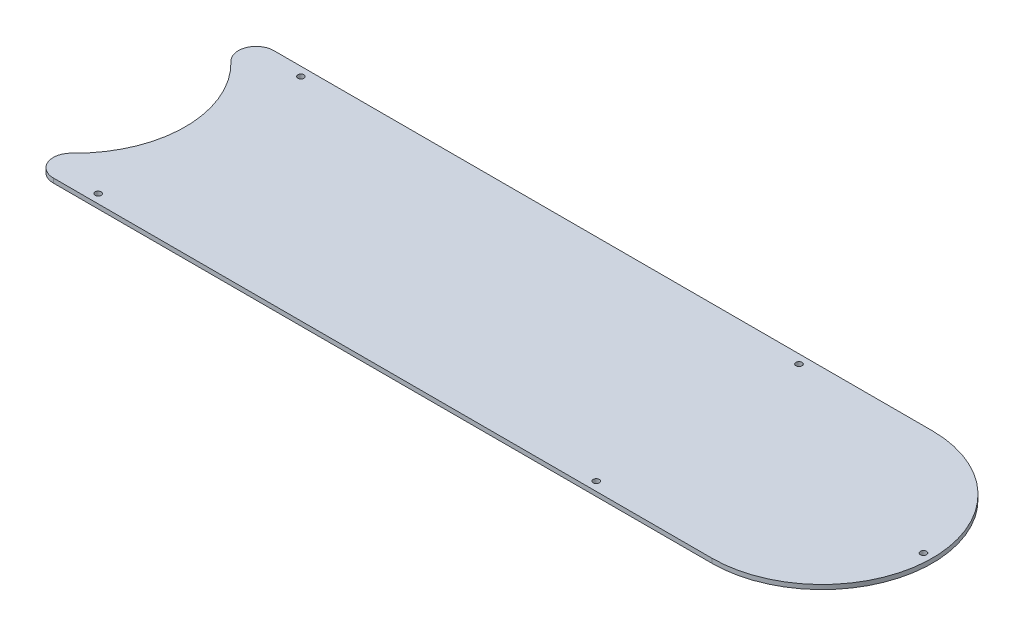
ISO-10303-21;
HEADER;
FILE_DESCRIPTION(('STEP AP214'),'2;1');
FILE_NAME('part.step','',(''),(''),'','','');
FILE_SCHEMA(('AUTOMOTIVE_DESIGN { 1 0 10303 214 1 1 1 1 }'));
ENDSEC;
DATA;
#1=APPLICATION_CONTEXT('core data for automotive mechanical design processes');
#2=APPLICATION_PROTOCOL_DEFINITION('international standard','automotive_design',2000,#1);
#3=PRODUCT_CONTEXT('',#1,'mechanical');
#4=PRODUCT('Part','Part','',(#3));
#5=PRODUCT_RELATED_PRODUCT_CATEGORY('part','',(#4));
#6=PRODUCT_DEFINITION_FORMATION('','',#4);
#7=PRODUCT_DEFINITION_CONTEXT('part definition',#1,'design');
#8=PRODUCT_DEFINITION('design','',#6,#7);
#9=PRODUCT_DEFINITION_SHAPE('','',#8);
#10=(LENGTH_UNIT() NAMED_UNIT(*) SI_UNIT(.MILLI.,.METRE.));
#11=(NAMED_UNIT(*) PLANE_ANGLE_UNIT() SI_UNIT($,.RADIAN.));
#12=(NAMED_UNIT(*) SI_UNIT($,.STERADIAN.) SOLID_ANGLE_UNIT());
#13=UNCERTAINTY_MEASURE_WITH_UNIT(LENGTH_MEASURE(1.E-05),#10,'distance_accuracy_value','');
#14=(GEOMETRIC_REPRESENTATION_CONTEXT(3) GLOBAL_UNCERTAINTY_ASSIGNED_CONTEXT((#13)) GLOBAL_UNIT_ASSIGNED_CONTEXT((#10,
#11,#12)) REPRESENTATION_CONTEXT('',''));
#15=CARTESIAN_POINT('',(0.,0.,0.));
#16=DIRECTION('',(0.,0.,1.));
#17=DIRECTION('',(1.,0.,0.));
#18=AXIS2_PLACEMENT_3D('',#15,#16,#17);
#19=CARTESIAN_POINT('',(266.7,1.5875,0.));
#20=DIRECTION('',(0.,1.,0.));
#21=DIRECTION('',(0.,0.,1.));
#22=AXIS2_PLACEMENT_3D('',#19,#20,#21);
#23=PLANE('',#22);
#24=CARTESIAN_POINT('',(44.45,1.5875,36.195));
#25=DIRECTION('',(0.,1.,0.));
#26=DIRECTION('',(0.,0.,-1.));
#27=AXIS2_PLACEMENT_3D('',#24,#25,#26);
#28=CIRCLE('',#27,1.0922);
#29=CARTESIAN_POINT('',(44.45,1.5875,35.1028));
#30=VERTEX_POINT('',#29);
#31=EDGE_CURVE('E162',#30,#30,#28,.T.);
#32=ORIENTED_EDGE('',*,*,#31,.F.);
#33=EDGE_LOOP('',(#32));
#34=FACE_BOUND('',#33,.T.);
#35=CARTESIAN_POINT('',(222.25,1.5875,-36.195));
#36=DIRECTION('',(0.,1.,0.));
#37=DIRECTION('',(0.,0.,1.));
#38=AXIS2_PLACEMENT_3D('',#35,#36,#37);
#39=CIRCLE('',#38,1.09219999999998);
#40=CARTESIAN_POINT('',(222.25,1.5875,-35.1028000000001));
#41=VERTEX_POINT('',#40);
#42=EDGE_CURVE('E150',#41,#41,#39,.T.);
#43=ORIENTED_EDGE('',*,*,#42,.F.);
#44=EDGE_LOOP('',(#43));
#45=FACE_BOUND('',#44,.T.);
#46=CARTESIAN_POINT('',(0.,1.5875,0.));
#47=DIRECTION('',(0.,-1.,0.));
#48=DIRECTION('',(0.,0.,1.));
#49=AXIS2_PLACEMENT_3D('',#46,#47,#48);
#50=CIRCLE('',#49,39.37);
#51=CARTESIAN_POINT('',(27.2306970651565,1.5875,-28.4338888888889));
#52=VERTEX_POINT('',#51);
#53=CARTESIAN_POINT('',(27.2306970651565,1.5875,28.4338888888889));
#54=VERTEX_POINT('',#53);
#55=EDGE_CURVE('E93',#52,#54,#50,.T.);
#56=ORIENTED_EDGE('',*,*,#55,.T.);
#57=CARTESIAN_POINT('',(31.6227449788914,1.5875,33.02));
#58=DIRECTION('',(0.,1.,0.));
#59=DIRECTION('',(0.,0.,1.));
#60=AXIS2_PLACEMENT_3D('',#57,#58,#59);
#61=CIRCLE('',#60,6.35);
#62=CARTESIAN_POINT('',(31.6227449788914,1.5875,39.37));
#63=VERTEX_POINT('',#62);
#64=EDGE_CURVE('E41',#54,#63,#61,.T.);
#65=ORIENTED_EDGE('',*,*,#64,.T.);
#66=DIRECTION('',(1.,0.,0.));
#67=VECTOR('',#66,1.);
#68=CARTESIAN_POINT('',(0.,1.5875,39.37));
#69=LINE('',#68,#67);
#70=CARTESIAN_POINT('',(266.7,1.5875,39.37));
#71=VERTEX_POINT('',#70);
#72=EDGE_CURVE('E99',#63,#71,#69,.T.);
#73=ORIENTED_EDGE('',*,*,#72,.T.);
#74=CARTESIAN_POINT('',(266.7,1.5875,0.));
#75=DIRECTION('',(0.,1.,0.));
#76=DIRECTION('',(0.,0.,1.));
#77=AXIS2_PLACEMENT_3D('',#74,#75,#76);
#78=CIRCLE('',#77,39.37);
#79=CARTESIAN_POINT('',(266.7,1.5875,-39.37));
#80=VERTEX_POINT('',#79);
#81=EDGE_CURVE('E94',#71,#80,#78,.T.);
#82=ORIENTED_EDGE('',*,*,#81,.T.);
#83=DIRECTION('',(-1.,0.,0.));
#84=VECTOR('',#83,1.);
#85=CARTESIAN_POINT('',(266.7,1.5875,-39.37));
#86=LINE('',#85,#84);
#87=CARTESIAN_POINT('',(31.6227449788914,1.5875,-39.37));
#88=VERTEX_POINT('',#87);
#89=EDGE_CURVE('E85',#80,#88,#86,.T.);
#90=ORIENTED_EDGE('',*,*,#89,.T.);
#91=CARTESIAN_POINT('',(31.6227449788914,1.5875,-33.02));
#92=DIRECTION('',(0.,1.,0.));
#93=DIRECTION('',(0.,0.,1.));
#94=AXIS2_PLACEMENT_3D('',#91,#92,#93);
#95=CIRCLE('',#94,6.35);
#96=EDGE_CURVE('E124',#88,#52,#95,.T.);
#97=ORIENTED_EDGE('',*,*,#96,.T.);
#98=EDGE_LOOP('',(#56,#65,#73,#82,#90,#97));
#99=FACE_BOUND('',#98,.T.);
#100=CARTESIAN_POINT('',(302.895,1.5875,0.));
#101=DIRECTION('',(0.,1.,0.));
#102=DIRECTION('',(0.,0.,1.));
#103=AXIS2_PLACEMENT_3D('',#100,#101,#102);
#104=CIRCLE('',#103,1.09220000000001);
#105=CARTESIAN_POINT('',(302.895,1.5875,1.09220000000001));
#106=VERTEX_POINT('',#105);
#107=EDGE_CURVE('E144',#106,#106,#104,.T.);
#108=ORIENTED_EDGE('',*,*,#107,.F.);
#109=EDGE_LOOP('',(#108));
#110=FACE_BOUND('',#109,.T.);
#111=CARTESIAN_POINT('',(44.45,1.5875,-36.195));
#112=DIRECTION('',(0.,1.,0.));
#113=DIRECTION('',(0.,0.,1.));
#114=AXIS2_PLACEMENT_3D('',#111,#112,#113);
#115=CIRCLE('',#114,1.0922);
#116=CARTESIAN_POINT('',(44.45,1.5875,-35.1028));
#117=VERTEX_POINT('',#116);
#118=EDGE_CURVE('E156',#117,#117,#115,.T.);
#119=ORIENTED_EDGE('',*,*,#118,.F.);
#120=EDGE_LOOP('',(#119));
#121=FACE_BOUND('',#120,.T.);
#122=CARTESIAN_POINT('',(222.25,1.5875,36.195));
#123=DIRECTION('',(0.,1.,0.));
#124=DIRECTION('',(0.,0.,-1.));
#125=AXIS2_PLACEMENT_3D('',#122,#123,#124);
#126=CIRCLE('',#125,1.09219999999998);
#127=CARTESIAN_POINT('',(222.25,1.5875,35.1028000000001));
#128=VERTEX_POINT('',#127);
#129=EDGE_CURVE('E168',#128,#128,#126,.T.);
#130=ORIENTED_EDGE('',*,*,#129,.F.);
#131=EDGE_LOOP('',(#130));
#132=FACE_BOUND('',#131,.T.);
#133=ADVANCED_FACE('F33',(#34,#45,#99,#110,#121,#132),#23,.T.);
#134=CARTESIAN_POINT('',(266.7,0.,0.));
#135=DIRECTION('',(0.,1.,0.));
#136=DIRECTION('',(0.,0.,1.));
#137=AXIS2_PLACEMENT_3D('',#134,#135,#136);
#138=PLANE('',#137);
#139=CARTESIAN_POINT('',(44.45,0.,36.195));
#140=DIRECTION('',(0.,1.,0.));
#141=DIRECTION('',(0.,0.,-1.));
#142=AXIS2_PLACEMENT_3D('',#139,#140,#141);
#143=CIRCLE('',#142,1.0922);
#144=CARTESIAN_POINT('',(44.45,0.,35.1028));
#145=VERTEX_POINT('',#144);
#146=EDGE_CURVE('E165',#145,#145,#143,.T.);
#147=ORIENTED_EDGE('',*,*,#146,.T.);
#148=EDGE_LOOP('',(#147));
#149=FACE_BOUND('',#148,.T.);
#150=CARTESIAN_POINT('',(222.25,0.,-36.195));
#151=DIRECTION('',(0.,1.,0.));
#152=DIRECTION('',(0.,0.,1.));
#153=AXIS2_PLACEMENT_3D('',#150,#151,#152);
#154=CIRCLE('',#153,1.09219999999998);
#155=CARTESIAN_POINT('',(222.25,0.,-35.1028000000001));
#156=VERTEX_POINT('',#155);
#157=EDGE_CURVE('E153',#156,#156,#154,.T.);
#158=ORIENTED_EDGE('',*,*,#157,.T.);
#159=EDGE_LOOP('',(#158));
#160=FACE_BOUND('',#159,.T.);
#161=DIRECTION('',(1.,0.,0.));
#162=VECTOR('',#161,1.);
#163=CARTESIAN_POINT('',(0.,0.,39.37));
#164=LINE('',#163,#162);
#165=CARTESIAN_POINT('',(31.6227449788914,0.,39.37));
#166=VERTEX_POINT('',#165);
#167=CARTESIAN_POINT('',(266.7,0.,39.37));
#168=VERTEX_POINT('',#167);
#169=EDGE_CURVE('E103',#166,#168,#164,.T.);
#170=ORIENTED_EDGE('',*,*,#169,.F.);
#171=CARTESIAN_POINT('',(31.6227449788914,0.,33.02));
#172=DIRECTION('',(0.,1.,0.));
#173=DIRECTION('',(0.,0.,1.));
#174=AXIS2_PLACEMENT_3D('',#171,#172,#173);
#175=CIRCLE('',#174,6.35);
#176=CARTESIAN_POINT('',(27.2306970651565,0.,28.4338888888889));
#177=VERTEX_POINT('',#176);
#178=EDGE_CURVE('E118',#166,#177,#175,.F.);
#179=ORIENTED_EDGE('',*,*,#178,.T.);
#180=CARTESIAN_POINT('',(0.,0.,0.));
#181=DIRECTION('',(0.,-1.,0.));
#182=DIRECTION('',(0.,0.,1.));
#183=AXIS2_PLACEMENT_3D('',#180,#181,#182);
#184=CIRCLE('',#183,39.37);
#185=CARTESIAN_POINT('',(27.2306970651565,0.,-28.4338888888889));
#186=VERTEX_POINT('',#185);
#187=EDGE_CURVE('E137',#186,#177,#184,.T.);
#188=ORIENTED_EDGE('',*,*,#187,.F.);
#189=CARTESIAN_POINT('',(31.6227449788914,0.,-33.02));
#190=DIRECTION('',(0.,1.,0.));
#191=DIRECTION('',(0.,0.,1.));
#192=AXIS2_PLACEMENT_3D('',#189,#190,#191);
#193=CIRCLE('',#192,6.35);
#194=CARTESIAN_POINT('',(31.6227449788914,0.,-39.37));
#195=VERTEX_POINT('',#194);
#196=EDGE_CURVE('E112',#186,#195,#193,.F.);
#197=ORIENTED_EDGE('',*,*,#196,.T.);
#198=DIRECTION('',(-1.,0.,0.));
#199=VECTOR('',#198,1.);
#200=CARTESIAN_POINT('',(266.7,0.,-39.37));
#201=LINE('',#200,#199);
#202=CARTESIAN_POINT('',(266.7,0.,-39.37));
#203=VERTEX_POINT('',#202);
#204=EDGE_CURVE('E140',#203,#195,#201,.T.);
#205=ORIENTED_EDGE('',*,*,#204,.F.);
#206=CARTESIAN_POINT('',(266.7,0.,0.));
#207=DIRECTION('',(0.,1.,0.));
#208=DIRECTION('',(0.,0.,1.));
#209=AXIS2_PLACEMENT_3D('',#206,#207,#208);
#210=CIRCLE('',#209,39.37);
#211=EDGE_CURVE('E107',#168,#203,#210,.T.);
#212=ORIENTED_EDGE('',*,*,#211,.F.);
#213=EDGE_LOOP('',(#170,#179,#188,#197,#205,#212));
#214=FACE_BOUND('',#213,.T.);
#215=CARTESIAN_POINT('',(302.895,0.,0.));
#216=DIRECTION('',(0.,1.,0.));
#217=DIRECTION('',(0.,0.,1.));
#218=AXIS2_PLACEMENT_3D('',#215,#216,#217);
#219=CIRCLE('',#218,1.09220000000001);
#220=CARTESIAN_POINT('',(302.895,0.,1.09220000000001));
#221=VERTEX_POINT('',#220);
#222=EDGE_CURVE('E147',#221,#221,#219,.T.);
#223=ORIENTED_EDGE('',*,*,#222,.T.);
#224=EDGE_LOOP('',(#223));
#225=FACE_BOUND('',#224,.T.);
#226=CARTESIAN_POINT('',(44.45,0.,-36.195));
#227=DIRECTION('',(0.,1.,0.));
#228=DIRECTION('',(0.,0.,1.));
#229=AXIS2_PLACEMENT_3D('',#226,#227,#228);
#230=CIRCLE('',#229,1.0922);
#231=CARTESIAN_POINT('',(44.45,0.,-35.1028));
#232=VERTEX_POINT('',#231);
#233=EDGE_CURVE('E159',#232,#232,#230,.T.);
#234=ORIENTED_EDGE('',*,*,#233,.T.);
#235=EDGE_LOOP('',(#234));
#236=FACE_BOUND('',#235,.T.);
#237=CARTESIAN_POINT('',(222.25,0.,36.195));
#238=DIRECTION('',(0.,1.,0.));
#239=DIRECTION('',(0.,0.,-1.));
#240=AXIS2_PLACEMENT_3D('',#237,#238,#239);
#241=CIRCLE('',#240,1.09219999999998);
#242=CARTESIAN_POINT('',(222.25,0.,35.1028000000001));
#243=VERTEX_POINT('',#242);
#244=EDGE_CURVE('E171',#243,#243,#241,.T.);
#245=ORIENTED_EDGE('',*,*,#244,.T.);
#246=EDGE_LOOP('',(#245));
#247=FACE_BOUND('',#246,.T.);
#248=ADVANCED_FACE('F135',(#149,#160,#214,#225,#236,#247),#138,.F.);
#249=CARTESIAN_POINT('',(266.7,1.5875,0.));
#250=DIRECTION('',(0.,-1.,0.));
#251=DIRECTION('',(0.,0.,-1.));
#252=AXIS2_PLACEMENT_3D('',#249,#250,#251);
#253=CYLINDRICAL_SURFACE('',#252,39.37);
#254=ORIENTED_EDGE('',*,*,#211,.T.);
#255=DIRECTION('',(0.,-1.,0.));
#256=VECTOR('',#255,1.);
#257=CARTESIAN_POINT('',(266.7,1.5875,-39.37));
#258=LINE('',#257,#256);
#259=EDGE_CURVE('E89',#80,#203,#258,.T.);
#260=ORIENTED_EDGE('',*,*,#259,.F.);
#261=ORIENTED_EDGE('',*,*,#81,.F.);
#262=DIRECTION('',(0.,-1.,0.));
#263=VECTOR('',#262,1.);
#264=CARTESIAN_POINT('',(266.7,1.5875,39.37));
#265=LINE('',#264,#263);
#266=EDGE_CURVE('E109',#71,#168,#265,.T.);
#267=ORIENTED_EDGE('',*,*,#266,.T.);
#268=EDGE_LOOP('',(#254,#260,#261,#267));
#269=FACE_BOUND('',#268,.T.);
#270=ADVANCED_FACE('F105',(#269),#253,.T.);
#271=CARTESIAN_POINT('',(266.7,1.5875,-39.37));
#272=DIRECTION('',(0.,0.,1.));
#273=DIRECTION('',(1.,0.,0.));
#274=AXIS2_PLACEMENT_3D('',#271,#272,#273);
#275=PLANE('',#274);
#276=ORIENTED_EDGE('',*,*,#204,.T.);
#277=DIRECTION('',(0.,-1.,0.));
#278=VECTOR('',#277,1.);
#279=CARTESIAN_POINT('',(31.6227449788914,1.5875,-39.37));
#280=LINE('',#279,#278);
#281=EDGE_CURVE('E11',#195,#88,#280,.F.);
#282=ORIENTED_EDGE('',*,*,#281,.T.);
#283=ORIENTED_EDGE('',*,*,#89,.F.);
#284=ORIENTED_EDGE('',*,*,#259,.T.);
#285=EDGE_LOOP('',(#276,#282,#283,#284));
#286=FACE_BOUND('',#285,.T.);
#287=ADVANCED_FACE('F87',(#286),#275,.F.);
#288=CARTESIAN_POINT('',(0.,1.5875,0.));
#289=DIRECTION('',(0.,-1.,0.));
#290=DIRECTION('',(0.,0.,-1.));
#291=AXIS2_PLACEMENT_3D('',#288,#289,#290);
#292=CYLINDRICAL_SURFACE('',#291,39.37);
#293=ORIENTED_EDGE('',*,*,#187,.T.);
#294=DIRECTION('',(0.,-1.,0.));
#295=VECTOR('',#294,1.);
#296=CARTESIAN_POINT('',(27.2306970651565,1.5875,28.4338888888889));
#297=LINE('',#296,#295);
#298=EDGE_CURVE('E54',#177,#54,#297,.F.);
#299=ORIENTED_EDGE('',*,*,#298,.T.);
#300=ORIENTED_EDGE('',*,*,#55,.F.);
#301=DIRECTION('',(0.,-1.,0.));
#302=VECTOR('',#301,1.);
#303=CARTESIAN_POINT('',(27.2306970651565,1.5875,-28.4338888888889));
#304=LINE('',#303,#302);
#305=EDGE_CURVE('E120',#52,#186,#304,.T.);
#306=ORIENTED_EDGE('',*,*,#305,.T.);
#307=EDGE_LOOP('',(#293,#299,#300,#306));
#308=FACE_BOUND('',#307,.T.);
#309=ADVANCED_FACE('F138',(#308),#292,.F.);
#310=CARTESIAN_POINT('',(0.,1.5875,39.37));
#311=DIRECTION('',(0.,0.,-1.));
#312=DIRECTION('',(-1.,0.,0.));
#313=AXIS2_PLACEMENT_3D('',#310,#311,#312);
#314=PLANE('',#313);
#315=ORIENTED_EDGE('',*,*,#72,.F.);
#316=DIRECTION('',(0.,-1.,0.));
#317=VECTOR('',#316,1.);
#318=CARTESIAN_POINT('',(31.6227449788914,1.5875,39.37));
#319=LINE('',#318,#317);
#320=EDGE_CURVE('E108',#63,#166,#319,.T.);
#321=ORIENTED_EDGE('',*,*,#320,.T.);
#322=ORIENTED_EDGE('',*,*,#169,.T.);
#323=ORIENTED_EDGE('',*,*,#266,.F.);
#324=EDGE_LOOP('',(#315,#321,#322,#323));
#325=FACE_BOUND('',#324,.T.);
#326=ADVANCED_FACE('F129',(#325),#314,.F.);
#327=CARTESIAN_POINT('',(302.895,1.5875,0.));
#328=DIRECTION('',(0.,-1.,0.));
#329=DIRECTION('',(0.,0.,-1.));
#330=AXIS2_PLACEMENT_3D('',#327,#328,#329);
#331=CYLINDRICAL_SURFACE('',#330,1.09220000000001);
#332=ORIENTED_EDGE('',*,*,#107,.T.);
#333=EDGE_LOOP('',(#332));
#334=FACE_BOUND('',#333,.T.);
#335=ORIENTED_EDGE('',*,*,#222,.F.);
#336=EDGE_LOOP('',(#335));
#337=FACE_BOUND('',#336,.T.);
#338=ADVANCED_FACE('F191',(#334,#337),#331,.F.);
#339=CARTESIAN_POINT('',(222.25,1.5875,-36.195));
#340=DIRECTION('',(0.,-1.,0.));
#341=DIRECTION('',(0.,0.,-1.));
#342=AXIS2_PLACEMENT_3D('',#339,#340,#341);
#343=CYLINDRICAL_SURFACE('',#342,1.09219999999998);
#344=ORIENTED_EDGE('',*,*,#42,.T.);
#345=EDGE_LOOP('',(#344));
#346=FACE_BOUND('',#345,.T.);
#347=ORIENTED_EDGE('',*,*,#157,.F.);
#348=EDGE_LOOP('',(#347));
#349=FACE_BOUND('',#348,.T.);
#350=ADVANCED_FACE('F217',(#346,#349),#343,.F.);
#351=CARTESIAN_POINT('',(44.45,1.5875,-36.195));
#352=DIRECTION('',(0.,-1.,0.));
#353=DIRECTION('',(0.,0.,-1.));
#354=AXIS2_PLACEMENT_3D('',#351,#352,#353);
#355=CYLINDRICAL_SURFACE('',#354,1.0922);
#356=ORIENTED_EDGE('',*,*,#118,.T.);
#357=EDGE_LOOP('',(#356));
#358=FACE_BOUND('',#357,.T.);
#359=ORIENTED_EDGE('',*,*,#233,.F.);
#360=EDGE_LOOP('',(#359));
#361=FACE_BOUND('',#360,.T.);
#362=ADVANCED_FACE('F212',(#358,#361),#355,.F.);
#363=CARTESIAN_POINT('',(44.45,1.5875,36.195));
#364=DIRECTION('',(0.,-1.,0.));
#365=DIRECTION('',(0.,0.,-1.));
#366=AXIS2_PLACEMENT_3D('',#363,#364,#365);
#367=CYLINDRICAL_SURFACE('',#366,1.0922);
#368=ORIENTED_EDGE('',*,*,#31,.T.);
#369=EDGE_LOOP('',(#368));
#370=FACE_BOUND('',#369,.T.);
#371=ORIENTED_EDGE('',*,*,#146,.F.);
#372=EDGE_LOOP('',(#371));
#373=FACE_BOUND('',#372,.T.);
#374=ADVANCED_FACE('F207',(#370,#373),#367,.F.);
#375=CARTESIAN_POINT('',(222.25,1.5875,36.195));
#376=DIRECTION('',(0.,-1.,0.));
#377=DIRECTION('',(0.,0.,-1.));
#378=AXIS2_PLACEMENT_3D('',#375,#376,#377);
#379=CYLINDRICAL_SURFACE('',#378,1.09219999999998);
#380=ORIENTED_EDGE('',*,*,#129,.T.);
#381=EDGE_LOOP('',(#380));
#382=FACE_BOUND('',#381,.T.);
#383=ORIENTED_EDGE('',*,*,#244,.F.);
#384=EDGE_LOOP('',(#383));
#385=FACE_BOUND('',#384,.T.);
#386=ADVANCED_FACE('F177',(#382,#385),#379,.F.);
#387=CARTESIAN_POINT('',(31.6227449788914,1.5875,33.02));
#388=DIRECTION('',(0.,-1.,0.));
#389=DIRECTION('',(0.,0.,-1.));
#390=AXIS2_PLACEMENT_3D('',#387,#388,#389);
#391=CYLINDRICAL_SURFACE('',#390,6.35);
#392=ORIENTED_EDGE('',*,*,#64,.F.);
#393=ORIENTED_EDGE('',*,*,#298,.F.);
#394=ORIENTED_EDGE('',*,*,#178,.F.);
#395=ORIENTED_EDGE('',*,*,#320,.F.);
#396=EDGE_LOOP('',(#392,#393,#394,#395));
#397=FACE_BOUND('',#396,.T.);
#398=ADVANCED_FACE('F132',(#397),#391,.T.);
#399=CARTESIAN_POINT('',(31.6227449788914,1.5875,-33.02));
#400=DIRECTION('',(0.,-1.,0.));
#401=DIRECTION('',(0.,0.,-1.));
#402=AXIS2_PLACEMENT_3D('',#399,#400,#401);
#403=CYLINDRICAL_SURFACE('',#402,6.35);
#404=ORIENTED_EDGE('',*,*,#96,.F.);
#405=ORIENTED_EDGE('',*,*,#281,.F.);
#406=ORIENTED_EDGE('',*,*,#196,.F.);
#407=ORIENTED_EDGE('',*,*,#305,.F.);
#408=EDGE_LOOP('',(#404,#405,#406,#407));
#409=FACE_BOUND('',#408,.T.);
#410=ADVANCED_FACE('F35',(#409),#403,.T.);
#411=CLOSED_SHELL('',(#133,#248,#270,#287,#309,#326,#338,#350,#362,#374,#386,#398,#410));
#412=MANIFOLD_SOLID_BREP('B2',#411);
#413=ADVANCED_BREP_SHAPE_REPRESENTATION('',(#18,#412),#14);
#414=SHAPE_DEFINITION_REPRESENTATION(#9,#413);
ENDSEC;
END-ISO-10303-21;
